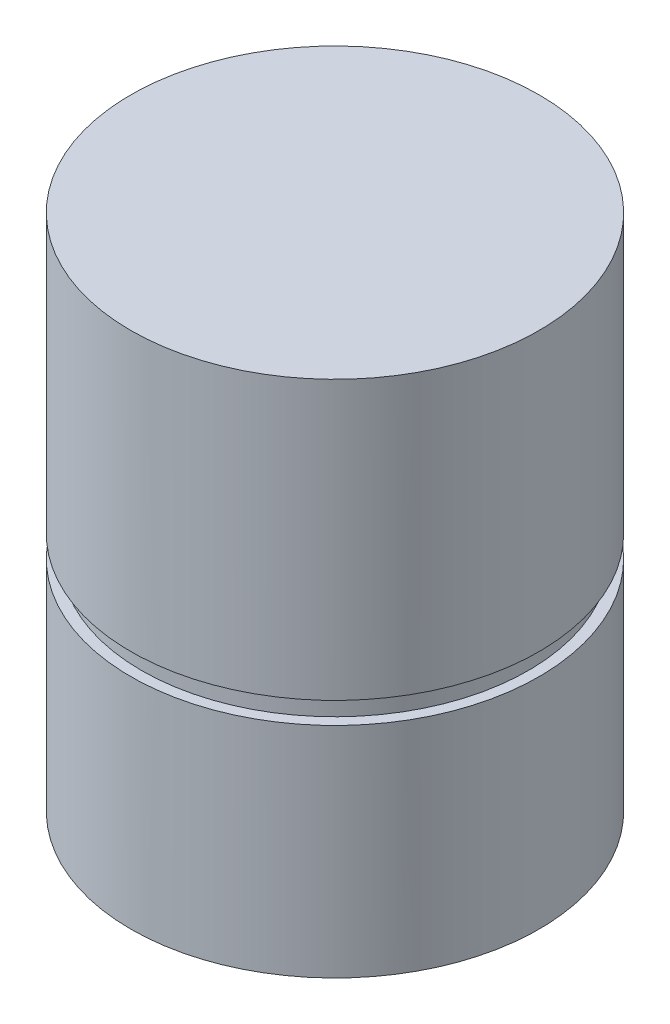
ISO-10303-21;
HEADER;
FILE_DESCRIPTION(('STEP AP214'),'2;1');
FILE_NAME('part.step','',(''),(''),'','','');
FILE_SCHEMA(('AUTOMOTIVE_DESIGN { 1 0 10303 214 1 1 1 1 }'));
ENDSEC;
DATA;
#1=APPLICATION_CONTEXT('core data for automotive mechanical design processes');
#2=APPLICATION_PROTOCOL_DEFINITION('international standard','automotive_design',2000,#1);
#3=PRODUCT_CONTEXT('',#1,'mechanical');
#4=PRODUCT('Part','Part','',(#3));
#5=PRODUCT_RELATED_PRODUCT_CATEGORY('part','',(#4));
#6=PRODUCT_DEFINITION_FORMATION('','',#4);
#7=PRODUCT_DEFINITION_CONTEXT('part definition',#1,'design');
#8=PRODUCT_DEFINITION('design','',#6,#7);
#9=PRODUCT_DEFINITION_SHAPE('','',#8);
#10=(LENGTH_UNIT() NAMED_UNIT(*) SI_UNIT(.MILLI.,.METRE.));
#11=(NAMED_UNIT(*) PLANE_ANGLE_UNIT() SI_UNIT($,.RADIAN.));
#12=(NAMED_UNIT(*) SI_UNIT($,.STERADIAN.) SOLID_ANGLE_UNIT());
#13=UNCERTAINTY_MEASURE_WITH_UNIT(LENGTH_MEASURE(1.E-05),#10,'distance_accuracy_value','');
#14=(GEOMETRIC_REPRESENTATION_CONTEXT(3) GLOBAL_UNCERTAINTY_ASSIGNED_CONTEXT((#13)) GLOBAL_UNIT_ASSIGNED_CONTEXT((#10,
#11,#12)) REPRESENTATION_CONTEXT('',''));
#15=CARTESIAN_POINT('',(0.,0.,0.));
#16=DIRECTION('',(0.,0.,1.));
#17=DIRECTION('',(1.,0.,0.));
#18=AXIS2_PLACEMENT_3D('',#15,#16,#17);
#19=CARTESIAN_POINT('',(0.,27.94,0.));
#20=DIRECTION('',(0.,-1.,0.));
#21=DIRECTION('',(0.,0.,-1.));
#22=AXIS2_PLACEMENT_3D('',#19,#20,#21);
#23=CYLINDRICAL_SURFACE('',#22,11.);
#24=CARTESIAN_POINT('',(0.,11.7856,0.));
#25=DIRECTION('',(0.,-1.,0.));
#26=DIRECTION('',(0.,0.,-1.));
#27=AXIS2_PLACEMENT_3D('',#24,#25,#26);
#28=CIRCLE('',#27,11.);
#29=CARTESIAN_POINT('',(0.,11.7856,-11.));
#30=VERTEX_POINT('',#29);
#31=EDGE_CURVE('E33',#30,#30,#28,.T.);
#32=ORIENTED_EDGE('',*,*,#31,.T.);
#33=EDGE_LOOP('',(#32));
#34=FACE_BOUND('',#33,.T.);
#35=CARTESIAN_POINT('',(0.,0.,0.));
#36=DIRECTION('',(0.,1.,0.));
#37=DIRECTION('',(0.,0.,1.));
#38=AXIS2_PLACEMENT_3D('',#35,#36,#37);
#39=CIRCLE('',#38,11.);
#40=CARTESIAN_POINT('',(0.,0.,11.));
#41=VERTEX_POINT('',#40);
#42=EDGE_CURVE('E37',#41,#41,#39,.T.);
#43=ORIENTED_EDGE('',*,*,#42,.T.);
#44=EDGE_LOOP('',(#43));
#45=FACE_BOUND('',#44,.T.);
#46=ADVANCED_FACE('F30',(#34,#45),#23,.T.);
#47=CARTESIAN_POINT('',(0.,0.,0.));
#48=DIRECTION('',(0.,1.,0.));
#49=DIRECTION('',(0.,0.,1.));
#50=AXIS2_PLACEMENT_3D('',#47,#48,#49);
#51=PLANE('',#50);
#52=ORIENTED_EDGE('',*,*,#42,.F.);
#53=EDGE_LOOP('',(#52));
#54=FACE_BOUND('',#53,.T.);
#55=ADVANCED_FACE('F74',(#54),#51,.F.);
#56=CARTESIAN_POINT('',(1.32415248664426,11.7856,556.596539748726));
#57=DIRECTION('',(0.,-1.,0.));
#58=DIRECTION('',(0.,0.,-1.));
#59=AXIS2_PLACEMENT_3D('',#56,#57,#58);
#60=PLANE('',#59);
#61=CARTESIAN_POINT('',(0.,11.7856,0.));
#62=DIRECTION('',(0.,1.,0.));
#63=DIRECTION('',(0.,0.,1.));
#64=AXIS2_PLACEMENT_3D('',#61,#62,#63);
#65=CIRCLE('',#64,10.4267);
#66=CARTESIAN_POINT('',(0.,11.7856,10.4267));
#67=VERTEX_POINT('',#66);
#68=EDGE_CURVE('E48',#67,#67,#65,.T.);
#69=ORIENTED_EDGE('',*,*,#68,.F.);
#70=EDGE_LOOP('',(#69));
#71=FACE_BOUND('',#70,.T.);
#72=ORIENTED_EDGE('',*,*,#31,.F.);
#73=EDGE_LOOP('',(#72));
#74=FACE_BOUND('',#73,.T.);
#75=ADVANCED_FACE('F70',(#71,#74),#60,.F.);
#76=CARTESIAN_POINT('',(1.32415248664426,12.954,556.596539748726));
#77=DIRECTION('',(0.,-1.,0.));
#78=DIRECTION('',(0.,0.,-1.));
#79=AXIS2_PLACEMENT_3D('',#76,#77,#78);
#80=PLANE('',#79);
#81=CARTESIAN_POINT('',(0.,12.954,0.));
#82=DIRECTION('',(0.,1.,0.));
#83=DIRECTION('',(0.,0.,1.));
#84=AXIS2_PLACEMENT_3D('',#81,#82,#83);
#85=CIRCLE('',#84,10.4267);
#86=CARTESIAN_POINT('',(0.,12.954,10.4267));
#87=VERTEX_POINT('',#86);
#88=EDGE_CURVE('E44',#87,#87,#85,.T.);
#89=ORIENTED_EDGE('',*,*,#88,.T.);
#90=EDGE_LOOP('',(#89));
#91=FACE_BOUND('',#90,.T.);
#92=CARTESIAN_POINT('',(0.,12.954,0.));
#93=DIRECTION('',(0.,-1.,0.));
#94=DIRECTION('',(0.,0.,-1.));
#95=AXIS2_PLACEMENT_3D('',#92,#93,#94);
#96=CIRCLE('',#95,11.);
#97=CARTESIAN_POINT('',(0.,12.954,-11.));
#98=VERTEX_POINT('',#97);
#99=EDGE_CURVE('E46',#98,#98,#96,.T.);
#100=ORIENTED_EDGE('',*,*,#99,.T.);
#101=EDGE_LOOP('',(#100));
#102=FACE_BOUND('',#101,.T.);
#103=ADVANCED_FACE('F58',(#91,#102),#80,.T.);
#104=CARTESIAN_POINT('',(0.,11.7856,0.));
#105=DIRECTION('',(0.,1.,0.));
#106=DIRECTION('',(0.,0.,1.));
#107=AXIS2_PLACEMENT_3D('',#104,#105,#106);
#108=CYLINDRICAL_SURFACE('',#107,10.4267);
#109=ORIENTED_EDGE('',*,*,#68,.T.);
#110=EDGE_LOOP('',(#109));
#111=FACE_BOUND('',#110,.T.);
#112=ORIENTED_EDGE('',*,*,#88,.F.);
#113=EDGE_LOOP('',(#112));
#114=FACE_BOUND('',#113,.T.);
#115=ADVANCED_FACE('F60',(#111,#114),#108,.T.);
#116=CARTESIAN_POINT('',(0.,27.94,0.));
#117=DIRECTION('',(0.,1.,0.));
#118=DIRECTION('',(0.,0.,1.));
#119=AXIS2_PLACEMENT_3D('',#116,#117,#118);
#120=PLANE('',#119);
#121=CARTESIAN_POINT('',(0.,27.94,0.));
#122=DIRECTION('',(0.,1.,0.));
#123=DIRECTION('',(0.,0.,1.));
#124=AXIS2_PLACEMENT_3D('',#121,#122,#123);
#125=CIRCLE('',#124,11.);
#126=CARTESIAN_POINT('',(0.,27.94,11.));
#127=VERTEX_POINT('',#126);
#128=EDGE_CURVE('E10',#127,#127,#125,.T.);
#129=ORIENTED_EDGE('',*,*,#128,.T.);
#130=EDGE_LOOP('',(#129));
#131=FACE_BOUND('',#130,.T.);
#132=ADVANCED_FACE('F62',(#131),#120,.T.);
#133=ORIENTED_EDGE('',*,*,#128,.F.);
#134=EDGE_LOOP('',(#133));
#135=FACE_BOUND('',#134,.T.);
#136=ORIENTED_EDGE('',*,*,#99,.F.);
#137=EDGE_LOOP('',(#136));
#138=FACE_BOUND('',#137,.T.);
#139=ADVANCED_FACE('F68',(#135,#138),#23,.T.);
#140=CLOSED_SHELL('',(#46,#55,#75,#103,#115,#132,#139));
#141=MANIFOLD_SOLID_BREP('B2',#140);
#142=ADVANCED_BREP_SHAPE_REPRESENTATION('',(#18,#141),#14);
#143=SHAPE_DEFINITION_REPRESENTATION(#9,#142);
ENDSEC;
END-ISO-10303-21;
